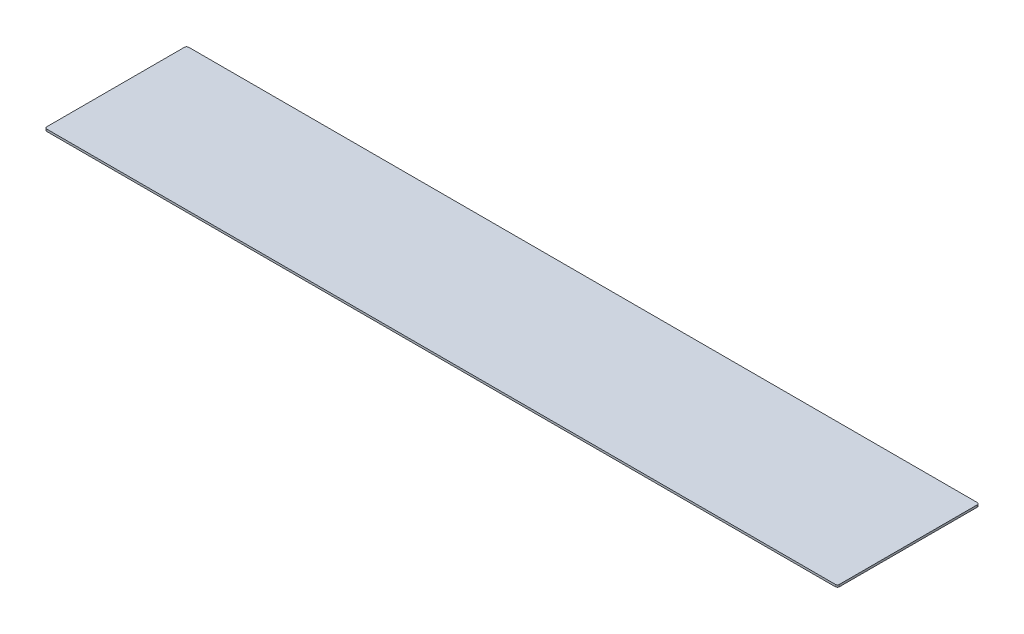
ISO-10303-21;
HEADER;
FILE_DESCRIPTION(('STEP AP214'),'2;1');
FILE_NAME('part.step','',(''),(''),'','','');
FILE_SCHEMA(('AUTOMOTIVE_DESIGN { 1 0 10303 214 1 1 1 1 }'));
ENDSEC;
DATA;
#1=APPLICATION_CONTEXT('core data for automotive mechanical design processes');
#2=APPLICATION_PROTOCOL_DEFINITION('international standard','automotive_design',2000,#1);
#3=PRODUCT_CONTEXT('',#1,'mechanical');
#4=PRODUCT('Part','Part','',(#3));
#5=PRODUCT_RELATED_PRODUCT_CATEGORY('part','',(#4));
#6=PRODUCT_DEFINITION_FORMATION('','',#4);
#7=PRODUCT_DEFINITION_CONTEXT('part definition',#1,'design');
#8=PRODUCT_DEFINITION('design','',#6,#7);
#9=PRODUCT_DEFINITION_SHAPE('','',#8);
#10=(LENGTH_UNIT() NAMED_UNIT(*) SI_UNIT(.MILLI.,.METRE.));
#11=(NAMED_UNIT(*) PLANE_ANGLE_UNIT() SI_UNIT($,.RADIAN.));
#12=(NAMED_UNIT(*) SI_UNIT($,.STERADIAN.) SOLID_ANGLE_UNIT());
#13=UNCERTAINTY_MEASURE_WITH_UNIT(LENGTH_MEASURE(1.E-05),#10,'distance_accuracy_value','');
#14=(GEOMETRIC_REPRESENTATION_CONTEXT(3) GLOBAL_UNCERTAINTY_ASSIGNED_CONTEXT((#13)) GLOBAL_UNIT_ASSIGNED_CONTEXT((#10,
#11,#12)) REPRESENTATION_CONTEXT('',''));
#15=CARTESIAN_POINT('',(0.,0.,0.));
#16=DIRECTION('',(0.,0.,1.));
#17=DIRECTION('',(1.,0.,0.));
#18=AXIS2_PLACEMENT_3D('',#15,#16,#17);
#19=CARTESIAN_POINT('',(591.185,3.175,-103.1875));
#20=DIRECTION('',(0.,-1.,0.));
#21=DIRECTION('',(0.,0.,-1.));
#22=AXIS2_PLACEMENT_3D('',#19,#20,#21);
#23=CYLINDRICAL_SURFACE('',#22,3.17500000000002);
#24=CARTESIAN_POINT('',(591.185,0.,-103.1875));
#25=DIRECTION('',(0.,1.,0.));
#26=DIRECTION('',(0.,0.,-1.));
#27=AXIS2_PLACEMENT_3D('',#24,#25,#26);
#28=CIRCLE('',#27,3.17500000000002);
#29=CARTESIAN_POINT('',(594.36,0.,-103.1875));
#30=VERTEX_POINT('',#29);
#31=CARTESIAN_POINT('',(591.185,0.,-106.3625));
#32=VERTEX_POINT('',#31);
#33=EDGE_CURVE('E133',#30,#32,#28,.T.);
#34=ORIENTED_EDGE('',*,*,#33,.T.);
#35=DIRECTION('',(0.,-1.,0.));
#36=VECTOR('',#35,1.);
#37=CARTESIAN_POINT('',(591.185,3.175,-106.3625));
#38=LINE('',#37,#36);
#39=CARTESIAN_POINT('',(591.185,3.175,-106.3625));
#40=VERTEX_POINT('',#39);
#41=EDGE_CURVE('E11',#40,#32,#38,.T.);
#42=ORIENTED_EDGE('',*,*,#41,.F.);
#43=CARTESIAN_POINT('',(591.185,3.175,-103.1875));
#44=DIRECTION('',(0.,1.,0.));
#45=DIRECTION('',(0.,0.,-1.));
#46=AXIS2_PLACEMENT_3D('',#43,#44,#45);
#47=CIRCLE('',#46,3.17500000000002);
#48=CARTESIAN_POINT('',(594.36,3.175,-103.1875));
#49=VERTEX_POINT('',#48);
#50=EDGE_CURVE('E147',#49,#40,#47,.T.);
#51=ORIENTED_EDGE('',*,*,#50,.F.);
#52=DIRECTION('',(0.,-1.,0.));
#53=VECTOR('',#52,1.);
#54=CARTESIAN_POINT('',(594.36,3.175,-103.1875));
#55=LINE('',#54,#53);
#56=EDGE_CURVE('E129',#49,#30,#55,.T.);
#57=ORIENTED_EDGE('',*,*,#56,.T.);
#58=EDGE_LOOP('',(#34,#42,#51,#57));
#59=FACE_BOUND('',#58,.T.);
#60=ADVANCED_FACE('F37',(#59),#23,.T.);
#61=CARTESIAN_POINT('',(-591.185,3.175,-106.3625));
#62=DIRECTION('',(0.,0.,1.));
#63=DIRECTION('',(1.,0.,0.));
#64=AXIS2_PLACEMENT_3D('',#61,#62,#63);
#65=PLANE('',#64);
#66=DIRECTION('',(-1.,0.,0.));
#67=VECTOR('',#66,1.);
#68=CARTESIAN_POINT('',(-591.185,0.,-106.3625));
#69=LINE('',#68,#67);
#70=CARTESIAN_POINT('',(-591.185,0.,-106.3625));
#71=VERTEX_POINT('',#70);
#72=EDGE_CURVE('E136',#32,#71,#69,.T.);
#73=ORIENTED_EDGE('',*,*,#72,.T.);
#74=DIRECTION('',(0.,-1.,0.));
#75=VECTOR('',#74,1.);
#76=CARTESIAN_POINT('',(-591.185,3.175,-106.3625));
#77=LINE('',#76,#75);
#78=CARTESIAN_POINT('',(-591.185,3.175,-106.3625));
#79=VERTEX_POINT('',#78);
#80=EDGE_CURVE('E45',#79,#71,#77,.T.);
#81=ORIENTED_EDGE('',*,*,#80,.F.);
#82=DIRECTION('',(-1.,0.,0.));
#83=VECTOR('',#82,1.);
#84=CARTESIAN_POINT('',(-591.185,3.175,-106.3625));
#85=LINE('',#84,#83);
#86=EDGE_CURVE('E96',#40,#79,#85,.T.);
#87=ORIENTED_EDGE('',*,*,#86,.F.);
#88=ORIENTED_EDGE('',*,*,#41,.T.);
#89=EDGE_LOOP('',(#73,#81,#87,#88));
#90=FACE_BOUND('',#89,.T.);
#91=ADVANCED_FACE('F182',(#90),#65,.F.);
#92=CARTESIAN_POINT('',(-591.185,3.175,-103.1875));
#93=DIRECTION('',(0.,-1.,0.));
#94=DIRECTION('',(0.,0.,-1.));
#95=AXIS2_PLACEMENT_3D('',#92,#93,#94);
#96=CYLINDRICAL_SURFACE('',#95,3.17500000000002);
#97=CARTESIAN_POINT('',(-591.185,0.,-103.1875));
#98=DIRECTION('',(0.,1.,0.));
#99=DIRECTION('',(0.,0.,-1.));
#100=AXIS2_PLACEMENT_3D('',#97,#98,#99);
#101=CIRCLE('',#100,3.17500000000002);
#102=CARTESIAN_POINT('',(-594.36,0.,-103.1875));
#103=VERTEX_POINT('',#102);
#104=EDGE_CURVE('E138',#71,#103,#101,.T.);
#105=ORIENTED_EDGE('',*,*,#104,.T.);
#106=DIRECTION('',(0.,-1.,0.));
#107=VECTOR('',#106,1.);
#108=CARTESIAN_POINT('',(-594.36,3.175,-103.1875));
#109=LINE('',#108,#107);
#110=CARTESIAN_POINT('',(-594.36,3.175,-103.1875));
#111=VERTEX_POINT('',#110);
#112=EDGE_CURVE('E154',#111,#103,#109,.T.);
#113=ORIENTED_EDGE('',*,*,#112,.F.);
#114=CARTESIAN_POINT('',(-591.185,3.175,-103.1875));
#115=DIRECTION('',(0.,1.,0.));
#116=DIRECTION('',(0.,0.,-1.));
#117=AXIS2_PLACEMENT_3D('',#114,#115,#116);
#118=CIRCLE('',#117,3.17500000000002);
#119=EDGE_CURVE('E162',#79,#111,#118,.T.);
#120=ORIENTED_EDGE('',*,*,#119,.F.);
#121=ORIENTED_EDGE('',*,*,#80,.T.);
#122=EDGE_LOOP('',(#105,#113,#120,#121));
#123=FACE_BOUND('',#122,.T.);
#124=ADVANCED_FACE('F160',(#123),#96,.T.);
#125=CARTESIAN_POINT('',(-594.36,3.175,103.1875));
#126=DIRECTION('',(1.,0.,0.));
#127=DIRECTION('',(0.,0.,-1.));
#128=AXIS2_PLACEMENT_3D('',#125,#126,#127);
#129=PLANE('',#128);
#130=DIRECTION('',(0.,0.,1.));
#131=VECTOR('',#130,1.);
#132=CARTESIAN_POINT('',(-594.36,0.,103.1875));
#133=LINE('',#132,#131);
#134=CARTESIAN_POINT('',(-594.36,0.,103.1875));
#135=VERTEX_POINT('',#134);
#136=EDGE_CURVE('E140',#103,#135,#133,.T.);
#137=ORIENTED_EDGE('',*,*,#136,.T.);
#138=DIRECTION('',(0.,-1.,0.));
#139=VECTOR('',#138,1.);
#140=CARTESIAN_POINT('',(-594.36,3.175,103.1875));
#141=LINE('',#140,#139);
#142=CARTESIAN_POINT('',(-594.36,3.175,103.1875));
#143=VERTEX_POINT('',#142);
#144=EDGE_CURVE('E151',#143,#135,#141,.T.);
#145=ORIENTED_EDGE('',*,*,#144,.F.);
#146=DIRECTION('',(0.,0.,1.));
#147=VECTOR('',#146,1.);
#148=CARTESIAN_POINT('',(-594.36,3.175,103.1875));
#149=LINE('',#148,#147);
#150=EDGE_CURVE('E174',#111,#143,#149,.T.);
#151=ORIENTED_EDGE('',*,*,#150,.F.);
#152=ORIENTED_EDGE('',*,*,#112,.T.);
#153=EDGE_LOOP('',(#137,#145,#151,#152));
#154=FACE_BOUND('',#153,.T.);
#155=ADVANCED_FACE('F170',(#154),#129,.F.);
#156=CARTESIAN_POINT('',(-591.185,3.175,103.1875));
#157=DIRECTION('',(0.,-1.,0.));
#158=DIRECTION('',(0.,0.,-1.));
#159=AXIS2_PLACEMENT_3D('',#156,#157,#158);
#160=CYLINDRICAL_SURFACE('',#159,3.17500000000002);
#161=CARTESIAN_POINT('',(-591.185,0.,103.1875));
#162=DIRECTION('',(0.,1.,0.));
#163=DIRECTION('',(0.,0.,-1.));
#164=AXIS2_PLACEMENT_3D('',#161,#162,#163);
#165=CIRCLE('',#164,3.17500000000002);
#166=CARTESIAN_POINT('',(-591.185,0.,106.3625));
#167=VERTEX_POINT('',#166);
#168=EDGE_CURVE('E142',#135,#167,#165,.T.);
#169=ORIENTED_EDGE('',*,*,#168,.T.);
#170=DIRECTION('',(0.,-1.,0.));
#171=VECTOR('',#170,1.);
#172=CARTESIAN_POINT('',(-591.185,3.175,106.3625));
#173=LINE('',#172,#171);
#174=CARTESIAN_POINT('',(-591.185,3.175,106.3625));
#175=VERTEX_POINT('',#174);
#176=EDGE_CURVE('E124',#175,#167,#173,.T.);
#177=ORIENTED_EDGE('',*,*,#176,.F.);
#178=CARTESIAN_POINT('',(-591.185,3.175,103.1875));
#179=DIRECTION('',(0.,1.,0.));
#180=DIRECTION('',(0.,0.,-1.));
#181=AXIS2_PLACEMENT_3D('',#178,#179,#180);
#182=CIRCLE('',#181,3.17500000000002);
#183=EDGE_CURVE('E115',#143,#175,#182,.T.);
#184=ORIENTED_EDGE('',*,*,#183,.F.);
#185=ORIENTED_EDGE('',*,*,#144,.T.);
#186=EDGE_LOOP('',(#169,#177,#184,#185));
#187=FACE_BOUND('',#186,.T.);
#188=ADVANCED_FACE('F173',(#187),#160,.T.);
#189=CARTESIAN_POINT('',(-591.185,3.175,106.3625));
#190=DIRECTION('',(0.,0.,-1.));
#191=DIRECTION('',(-1.,0.,0.));
#192=AXIS2_PLACEMENT_3D('',#189,#190,#191);
#193=PLANE('',#192);
#194=DIRECTION('',(1.,0.,0.));
#195=VECTOR('',#194,1.);
#196=CARTESIAN_POINT('',(-591.185,0.,106.3625));
#197=LINE('',#196,#195);
#198=CARTESIAN_POINT('',(591.185,0.,106.3625));
#199=VERTEX_POINT('',#198);
#200=EDGE_CURVE('E123',#167,#199,#197,.T.);
#201=ORIENTED_EDGE('',*,*,#200,.T.);
#202=DIRECTION('',(0.,-1.,0.));
#203=VECTOR('',#202,1.);
#204=CARTESIAN_POINT('',(591.185,3.175,106.3625));
#205=LINE('',#204,#203);
#206=CARTESIAN_POINT('',(591.185,3.175,106.3625));
#207=VERTEX_POINT('',#206);
#208=EDGE_CURVE('E120',#207,#199,#205,.T.);
#209=ORIENTED_EDGE('',*,*,#208,.F.);
#210=DIRECTION('',(1.,0.,0.));
#211=VECTOR('',#210,1.);
#212=CARTESIAN_POINT('',(-591.185,3.175,106.3625));
#213=LINE('',#212,#211);
#214=EDGE_CURVE('E109',#175,#207,#213,.T.);
#215=ORIENTED_EDGE('',*,*,#214,.F.);
#216=ORIENTED_EDGE('',*,*,#176,.T.);
#217=EDGE_LOOP('',(#201,#209,#215,#216));
#218=FACE_BOUND('',#217,.T.);
#219=ADVANCED_FACE('F121',(#218),#193,.F.);
#220=CARTESIAN_POINT('',(591.185,3.175,103.1875));
#221=DIRECTION('',(0.,-1.,0.));
#222=DIRECTION('',(0.,0.,-1.));
#223=AXIS2_PLACEMENT_3D('',#220,#221,#222);
#224=CYLINDRICAL_SURFACE('',#223,3.17500000000002);
#225=CARTESIAN_POINT('',(591.185,0.,103.1875));
#226=DIRECTION('',(0.,1.,0.));
#227=DIRECTION('',(0.,0.,1.));
#228=AXIS2_PLACEMENT_3D('',#225,#226,#227);
#229=CIRCLE('',#228,3.17500000000002);
#230=CARTESIAN_POINT('',(594.36,0.,103.1875));
#231=VERTEX_POINT('',#230);
#232=EDGE_CURVE('E82',#199,#231,#229,.T.);
#233=ORIENTED_EDGE('',*,*,#232,.T.);
#234=DIRECTION('',(0.,-1.,0.));
#235=VECTOR('',#234,1.);
#236=CARTESIAN_POINT('',(594.36,3.175,103.1875));
#237=LINE('',#236,#235);
#238=CARTESIAN_POINT('',(594.36,3.175,103.1875));
#239=VERTEX_POINT('',#238);
#240=EDGE_CURVE('E125',#239,#231,#237,.T.);
#241=ORIENTED_EDGE('',*,*,#240,.F.);
#242=CARTESIAN_POINT('',(591.185,3.175,103.1875));
#243=DIRECTION('',(0.,1.,0.));
#244=DIRECTION('',(0.,0.,1.));
#245=AXIS2_PLACEMENT_3D('',#242,#243,#244);
#246=CIRCLE('',#245,3.17500000000002);
#247=EDGE_CURVE('E113',#207,#239,#246,.T.);
#248=ORIENTED_EDGE('',*,*,#247,.F.);
#249=ORIENTED_EDGE('',*,*,#208,.T.);
#250=EDGE_LOOP('',(#233,#241,#248,#249));
#251=FACE_BOUND('',#250,.T.);
#252=ADVANCED_FACE('F127',(#251),#224,.T.);
#253=CARTESIAN_POINT('',(594.36,3.175,103.1875));
#254=DIRECTION('',(-1.,0.,0.));
#255=DIRECTION('',(0.,0.,1.));
#256=AXIS2_PLACEMENT_3D('',#253,#254,#255);
#257=PLANE('',#256);
#258=DIRECTION('',(0.,0.,-1.));
#259=VECTOR('',#258,1.);
#260=CARTESIAN_POINT('',(594.36,0.,103.1875));
#261=LINE('',#260,#259);
#262=EDGE_CURVE('E88',#231,#30,#261,.T.);
#263=ORIENTED_EDGE('',*,*,#262,.T.);
#264=ORIENTED_EDGE('',*,*,#56,.F.);
#265=DIRECTION('',(0.,0.,-1.));
#266=VECTOR('',#265,1.);
#267=CARTESIAN_POINT('',(594.36,3.175,103.1875));
#268=LINE('',#267,#266);
#269=EDGE_CURVE('E53',#239,#49,#268,.T.);
#270=ORIENTED_EDGE('',*,*,#269,.F.);
#271=ORIENTED_EDGE('',*,*,#240,.T.);
#272=EDGE_LOOP('',(#263,#264,#270,#271));
#273=FACE_BOUND('',#272,.T.);
#274=ADVANCED_FACE('F198',(#273),#257,.F.);
#275=CARTESIAN_POINT('',(591.185,3.175,-103.1875));
#276=DIRECTION('',(0.,-1.,0.));
#277=DIRECTION('',(0.,0.,-1.));
#278=AXIS2_PLACEMENT_3D('',#275,#276,#277);
#279=PLANE('',#278);
#280=ORIENTED_EDGE('',*,*,#50,.T.);
#281=ORIENTED_EDGE('',*,*,#86,.T.);
#282=ORIENTED_EDGE('',*,*,#119,.T.);
#283=ORIENTED_EDGE('',*,*,#150,.T.);
#284=ORIENTED_EDGE('',*,*,#183,.T.);
#285=ORIENTED_EDGE('',*,*,#214,.T.);
#286=ORIENTED_EDGE('',*,*,#247,.T.);
#287=ORIENTED_EDGE('',*,*,#269,.T.);
#288=EDGE_LOOP('',(#280,#281,#282,#283,#284,#285,#286,#287));
#289=FACE_BOUND('',#288,.T.);
#290=ADVANCED_FACE('F111',(#289),#279,.F.);
#291=CARTESIAN_POINT('',(591.185,0.,-103.1875));
#292=DIRECTION('',(0.,-1.,0.));
#293=DIRECTION('',(0.,0.,-1.));
#294=AXIS2_PLACEMENT_3D('',#291,#292,#293);
#295=PLANE('',#294);
#296=ORIENTED_EDGE('',*,*,#33,.F.);
#297=ORIENTED_EDGE('',*,*,#262,.F.);
#298=ORIENTED_EDGE('',*,*,#232,.F.);
#299=ORIENTED_EDGE('',*,*,#200,.F.);
#300=ORIENTED_EDGE('',*,*,#168,.F.);
#301=ORIENTED_EDGE('',*,*,#136,.F.);
#302=ORIENTED_EDGE('',*,*,#104,.F.);
#303=ORIENTED_EDGE('',*,*,#72,.F.);
#304=EDGE_LOOP('',(#296,#297,#298,#299,#300,#301,#302,#303));
#305=FACE_BOUND('',#304,.T.);
#306=ADVANCED_FACE('F166',(#305),#295,.T.);
#307=CLOSED_SHELL('',(#60,#91,#124,#155,#188,#219,#252,#274,#290,#306));
#308=MANIFOLD_SOLID_BREP('B2',#307);
#309=ADVANCED_BREP_SHAPE_REPRESENTATION('',(#18,#308),#14);
#310=SHAPE_DEFINITION_REPRESENTATION(#9,#309);
ENDSEC;
END-ISO-10303-21;
